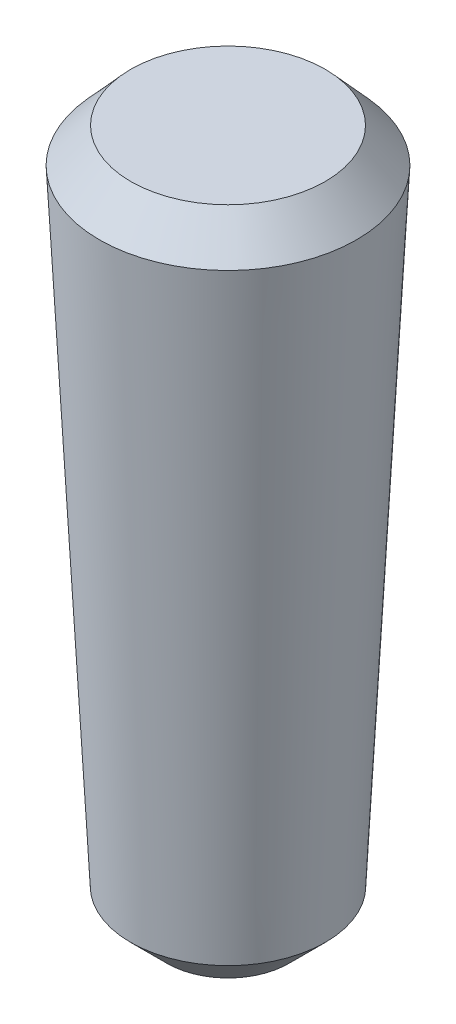
ISO-10303-21;
HEADER;
FILE_DESCRIPTION(('STEP AP214'),'2;1');
FILE_NAME('part.step','',(''),(''),'','','');
FILE_SCHEMA(('AUTOMOTIVE_DESIGN { 1 0 10303 214 1 1 1 1 }'));
ENDSEC;
DATA;
#1=APPLICATION_CONTEXT('core data for automotive mechanical design processes');
#2=APPLICATION_PROTOCOL_DEFINITION('international standard','automotive_design',2000,#1);
#3=PRODUCT_CONTEXT('',#1,'mechanical');
#4=PRODUCT('Part','Part','',(#3));
#5=PRODUCT_RELATED_PRODUCT_CATEGORY('part','',(#4));
#6=PRODUCT_DEFINITION_FORMATION('','',#4);
#7=PRODUCT_DEFINITION_CONTEXT('part definition',#1,'design');
#8=PRODUCT_DEFINITION('design','',#6,#7);
#9=PRODUCT_DEFINITION_SHAPE('','',#8);
#10=(LENGTH_UNIT() NAMED_UNIT(*) SI_UNIT(.MILLI.,.METRE.));
#11=(NAMED_UNIT(*) PLANE_ANGLE_UNIT() SI_UNIT($,.RADIAN.));
#12=(NAMED_UNIT(*) SI_UNIT($,.STERADIAN.) SOLID_ANGLE_UNIT());
#13=UNCERTAINTY_MEASURE_WITH_UNIT(LENGTH_MEASURE(1.E-05),#10,'distance_accuracy_value','');
#14=(GEOMETRIC_REPRESENTATION_CONTEXT(3) GLOBAL_UNCERTAINTY_ASSIGNED_CONTEXT((#13)) GLOBAL_UNIT_ASSIGNED_CONTEXT((#10,
#11,#12)) REPRESENTATION_CONTEXT('',''));
#15=CARTESIAN_POINT('',(0.,0.,0.));
#16=DIRECTION('',(0.,0.,1.));
#17=DIRECTION('',(1.,0.,0.));
#18=AXIS2_PLACEMENT_3D('',#15,#16,#17);
#19=CARTESIAN_POINT('',(0.,0.,0.));
#20=DIRECTION('',(0.,1.,0.));
#21=DIRECTION('',(0.,0.,1.));
#22=AXIS2_PLACEMENT_3D('',#19,#20,#21);
#23=PLANE('',#22);
#24=CARTESIAN_POINT('',(0.,0.,0.));
#25=DIRECTION('',(0.,1.,0.));
#26=DIRECTION('',(0.,0.,1.));
#27=AXIS2_PLACEMENT_3D('',#24,#25,#26);
#28=CIRCLE('',#27,0.874999999999996);
#29=CARTESIAN_POINT('',(0.,0.,0.874999999999996));
#30=VERTEX_POINT('',#29);
#31=EDGE_CURVE('E54',#30,#30,#28,.F.);
#32=ORIENTED_EDGE('',*,*,#31,.T.);
#33=EDGE_LOOP('',(#32));
#34=FACE_BOUND('',#33,.T.);
#35=ADVANCED_FACE('F45',(#34),#23,.F.);
#36=CARTESIAN_POINT('',(0.,10.,0.));
#37=DIRECTION('',(0.,1.,0.));
#38=DIRECTION('',(0.,0.,1.));
#39=AXIS2_PLACEMENT_3D('',#36,#37,#38);
#40=PLANE('',#39);
#41=CARTESIAN_POINT('',(0.,10.,0.));
#42=DIRECTION('',(0.,1.,0.));
#43=DIRECTION('',(0.,0.,1.));
#44=AXIS2_PLACEMENT_3D('',#41,#42,#43);
#45=CIRCLE('',#44,1.3982146572738);
#46=CARTESIAN_POINT('',(0.,10.,1.3982146572738));
#47=VERTEX_POINT('',#46);
#48=EDGE_CURVE('E11',#47,#47,#45,.T.);
#49=ORIENTED_EDGE('',*,*,#48,.T.);
#50=EDGE_LOOP('',(#49));
#51=FACE_BOUND('',#50,.T.);
#52=ADVANCED_FACE('F81',(#51),#40,.T.);
#53=CARTESIAN_POINT('',(0.,0.,0.));
#54=DIRECTION('',(0.,1.,0.));
#55=DIRECTION('',(0.,0.,1.));
#56=AXIS2_PLACEMENT_3D('',#53,#54,#55);
#57=CONICAL_SURFACE('',#56,1.375,0.0499583957219428);
#58=CARTESIAN_POINT('',(0.,0.526315789473686,0.));
#59=DIRECTION('',(0.,1.,0.));
#60=DIRECTION('',(0.,0.,1.));
#61=AXIS2_PLACEMENT_3D('',#58,#59,#60);
#62=CIRCLE('',#61,1.40131578947368);
#63=CARTESIAN_POINT('',(0.,0.526315789473686,1.40131578947368));
#64=VERTEX_POINT('',#63);
#65=EDGE_CURVE('E59',#64,#64,#62,.T.);
#66=ORIENTED_EDGE('',*,*,#65,.T.);
#67=EDGE_LOOP('',(#66));
#68=FACE_BOUND('',#67,.T.);
#69=CARTESIAN_POINT('',(0.,9.50062383056108,0.));
#70=DIRECTION('',(0.,-1.,0.));
#71=DIRECTION('',(0.,0.,-1.));
#72=AXIS2_PLACEMENT_3D('',#69,#70,#71);
#73=CIRCLE('',#72,1.85003119152805);
#74=CARTESIAN_POINT('',(0.,9.50062383056108,-1.85003119152805));
#75=VERTEX_POINT('',#74);
#76=EDGE_CURVE('E64',#75,#75,#73,.T.);
#77=ORIENTED_EDGE('',*,*,#76,.T.);
#78=EDGE_LOOP('',(#77));
#79=FACE_BOUND('',#78,.T.);
#80=ADVANCED_FACE('F71',(#68,#79),#57,.T.);
#81=CARTESIAN_POINT('',(0.,0.526315789473686,0.));
#82=DIRECTION('',(0.,1.,0.));
#83=DIRECTION('',(0.,0.,1.));
#84=AXIS2_PLACEMENT_3D('',#81,#82,#83);
#85=CONICAL_SURFACE('',#84,1.40131578947368,0.78539816339745);
#86=ORIENTED_EDGE('',*,*,#31,.F.);
#87=EDGE_LOOP('',(#86));
#88=FACE_BOUND('',#87,.T.);
#89=ORIENTED_EDGE('',*,*,#65,.F.);
#90=EDGE_LOOP('',(#89));
#91=FACE_BOUND('',#90,.T.);
#92=ADVANCED_FACE('F75',(#88,#91),#85,.T.);
#93=CARTESIAN_POINT('',(0.,10.,0.));
#94=DIRECTION('',(0.,-1.,0.));
#95=DIRECTION('',(0.,0.,-1.));
#96=AXIS2_PLACEMENT_3D('',#93,#94,#95);
#97=CONICAL_SURFACE('',#96,1.3982146572738,0.735439767675505);
#98=ORIENTED_EDGE('',*,*,#76,.F.);
#99=EDGE_LOOP('',(#98));
#100=FACE_BOUND('',#99,.T.);
#101=ORIENTED_EDGE('',*,*,#48,.F.);
#102=EDGE_LOOP('',(#101));
#103=FACE_BOUND('',#102,.T.);
#104=ADVANCED_FACE('F48',(#100,#103),#97,.T.);
#105=CLOSED_SHELL('',(#35,#52,#80,#92,#104));
#106=MANIFOLD_SOLID_BREP('B2',#105);
#107=ADVANCED_BREP_SHAPE_REPRESENTATION('',(#18,#106),#14);
#108=SHAPE_DEFINITION_REPRESENTATION(#9,#107);
ENDSEC;
END-ISO-10303-21;
